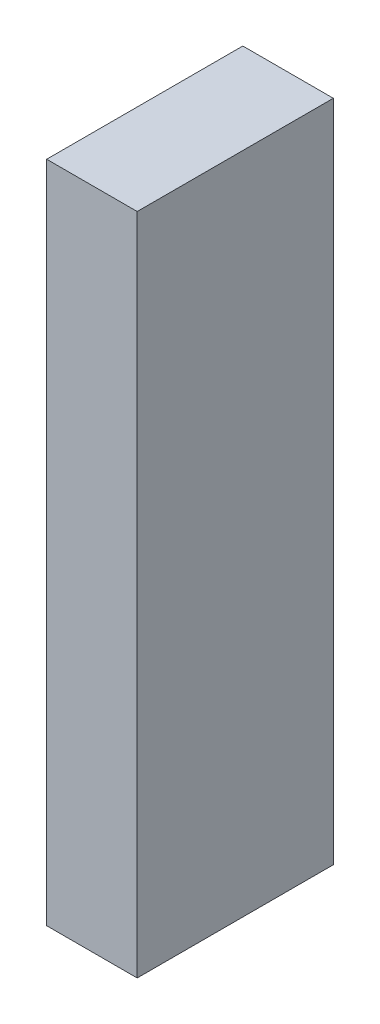
ISO-10303-21;
HEADER;
FILE_DESCRIPTION(('STEP AP214'),'2;1');
FILE_NAME('part.step','',(''),(''),'','','');
FILE_SCHEMA(('AUTOMOTIVE_DESIGN { 1 0 10303 214 1 1 1 1 }'));
ENDSEC;
DATA;
#1=APPLICATION_CONTEXT('core data for automotive mechanical design processes');
#2=APPLICATION_PROTOCOL_DEFINITION('international standard','automotive_design',2000,#1);
#3=PRODUCT_CONTEXT('',#1,'mechanical');
#4=PRODUCT('Part','Part','',(#3));
#5=PRODUCT_RELATED_PRODUCT_CATEGORY('part','',(#4));
#6=PRODUCT_DEFINITION_FORMATION('','',#4);
#7=PRODUCT_DEFINITION_CONTEXT('part definition',#1,'design');
#8=PRODUCT_DEFINITION('design','',#6,#7);
#9=PRODUCT_DEFINITION_SHAPE('','',#8);
#10=(LENGTH_UNIT() NAMED_UNIT(*) SI_UNIT(.MILLI.,.METRE.));
#11=(NAMED_UNIT(*) PLANE_ANGLE_UNIT() SI_UNIT($,.RADIAN.));
#12=(NAMED_UNIT(*) SI_UNIT($,.STERADIAN.) SOLID_ANGLE_UNIT());
#13=UNCERTAINTY_MEASURE_WITH_UNIT(LENGTH_MEASURE(1.E-05),#10,'distance_accuracy_value','');
#14=(GEOMETRIC_REPRESENTATION_CONTEXT(3) GLOBAL_UNCERTAINTY_ASSIGNED_CONTEXT((#13)) GLOBAL_UNIT_ASSIGNED_CONTEXT((#10,
#11,#12)) REPRESENTATION_CONTEXT('',''));
#15=CARTESIAN_POINT('',(0.,0.,0.));
#16=DIRECTION('',(0.,0.,1.));
#17=DIRECTION('',(1.,0.,0.));
#18=AXIS2_PLACEMENT_3D('',#15,#16,#17);
#19=CARTESIAN_POINT('',(-2.,-1.1,0.));
#20=DIRECTION('',(1.,0.,0.));
#21=DIRECTION('',(0.,0.,-1.));
#22=AXIS2_PLACEMENT_3D('',#19,#20,#21);
#23=PLANE('',#22);
#24=DIRECTION('',(0.,0.,1.));
#25=VECTOR('',#24,1.);
#26=CARTESIAN_POINT('',(-2.,-1.1,0.));
#27=LINE('',#26,#25);
#28=CARTESIAN_POINT('',(-2.,-1.1,0.65));
#29=VERTEX_POINT('',#28);
#30=CARTESIAN_POINT('',(-2.,-1.1,0.));
#31=VERTEX_POINT('',#30);
#32=EDGE_CURVE('E55',#29,#31,#27,.F.);
#33=ORIENTED_EDGE('',*,*,#32,.T.);
#34=DIRECTION('',(0.,1.,0.));
#35=VECTOR('',#34,1.);
#36=CARTESIAN_POINT('',(-2.,-1.1,0.));
#37=LINE('',#36,#35);
#38=CARTESIAN_POINT('',(-2.,1.1,0.));
#39=VERTEX_POINT('',#38);
#40=EDGE_CURVE('E75',#31,#39,#37,.T.);
#41=ORIENTED_EDGE('',*,*,#40,.T.);
#42=DIRECTION('',(0.,0.,-1.));
#43=VECTOR('',#42,1.);
#44=CARTESIAN_POINT('',(-2.,1.1,0.));
#45=LINE('',#44,#43);
#46=CARTESIAN_POINT('',(-2.,1.1,0.65));
#47=VERTEX_POINT('',#46);
#48=EDGE_CURVE('E20',#39,#47,#45,.F.);
#49=ORIENTED_EDGE('',*,*,#48,.T.);
#50=DIRECTION('',(0.,1.,0.));
#51=VECTOR('',#50,1.);
#52=CARTESIAN_POINT('',(-2.,-1.1,0.65));
#53=LINE('',#52,#51);
#54=EDGE_CURVE('E65',#29,#47,#53,.T.);
#55=ORIENTED_EDGE('',*,*,#54,.F.);
#56=EDGE_LOOP('',(#33,#41,#49,#55));
#57=FACE_BOUND('',#56,.T.);
#58=ADVANCED_FACE('F17',(#57),#23,.T.);
#59=CARTESIAN_POINT('',(-2.3,-1.1,0.65));
#60=DIRECTION('',(0.,0.,1.));
#61=DIRECTION('',(1.,0.,0.));
#62=AXIS2_PLACEMENT_3D('',#59,#60,#61);
#63=PLANE('',#62);
#64=DIRECTION('',(0.,1.,0.));
#65=VECTOR('',#64,1.);
#66=CARTESIAN_POINT('',(-2.3,-1.1,0.65));
#67=LINE('',#66,#65);
#68=CARTESIAN_POINT('',(-2.3,1.1,0.65));
#69=VERTEX_POINT('',#68);
#70=CARTESIAN_POINT('',(-2.3,-1.1,0.65));
#71=VERTEX_POINT('',#70);
#72=EDGE_CURVE('E73',#69,#71,#67,.F.);
#73=ORIENTED_EDGE('',*,*,#72,.T.);
#74=DIRECTION('',(1.,0.,0.));
#75=VECTOR('',#74,1.);
#76=CARTESIAN_POINT('',(-2.3,-1.1,0.65));
#77=LINE('',#76,#75);
#78=EDGE_CURVE('E62',#71,#29,#77,.T.);
#79=ORIENTED_EDGE('',*,*,#78,.T.);
#80=ORIENTED_EDGE('',*,*,#54,.T.);
#81=DIRECTION('',(1.,0.,0.));
#82=VECTOR('',#81,1.);
#83=CARTESIAN_POINT('',(-2.3,1.1,0.65));
#84=LINE('',#83,#82);
#85=EDGE_CURVE('E79',#69,#47,#84,.T.);
#86=ORIENTED_EDGE('',*,*,#85,.F.);
#87=EDGE_LOOP('',(#73,#79,#80,#86));
#88=FACE_BOUND('',#87,.T.);
#89=ADVANCED_FACE('F72',(#88),#63,.T.);
#90=CARTESIAN_POINT('',(-2.3,-1.1,0.));
#91=DIRECTION('',(0.,1.,0.));
#92=DIRECTION('',(0.,0.,1.));
#93=AXIS2_PLACEMENT_3D('',#90,#91,#92);
#94=PLANE('',#93);
#95=DIRECTION('',(0.,0.,-1.));
#96=VECTOR('',#95,1.);
#97=CARTESIAN_POINT('',(-2.3,-1.1,0.));
#98=LINE('',#97,#96);
#99=CARTESIAN_POINT('',(-2.3,-1.1,0.));
#100=VERTEX_POINT('',#99);
#101=EDGE_CURVE('E83',#71,#100,#98,.T.);
#102=ORIENTED_EDGE('',*,*,#101,.T.);
#103=DIRECTION('',(1.,0.,0.));
#104=VECTOR('',#103,1.);
#105=CARTESIAN_POINT('',(-2.3,-1.1,0.));
#106=LINE('',#105,#104);
#107=EDGE_CURVE('E64',#100,#31,#106,.T.);
#108=ORIENTED_EDGE('',*,*,#107,.T.);
#109=ORIENTED_EDGE('',*,*,#32,.F.);
#110=ORIENTED_EDGE('',*,*,#78,.F.);
#111=EDGE_LOOP('',(#102,#108,#109,#110));
#112=FACE_BOUND('',#111,.T.);
#113=ADVANCED_FACE('F60',(#112),#94,.F.);
#114=CARTESIAN_POINT('',(-2.3,-1.1,0.));
#115=DIRECTION('',(0.,0.,1.));
#116=DIRECTION('',(1.,0.,0.));
#117=AXIS2_PLACEMENT_3D('',#114,#115,#116);
#118=PLANE('',#117);
#119=ORIENTED_EDGE('',*,*,#107,.F.);
#120=DIRECTION('',(0.,1.,0.));
#121=VECTOR('',#120,1.);
#122=CARTESIAN_POINT('',(-2.3,-1.1,0.));
#123=LINE('',#122,#121);
#124=CARTESIAN_POINT('',(-2.3,1.1,0.));
#125=VERTEX_POINT('',#124);
#126=EDGE_CURVE('E26',#100,#125,#123,.T.);
#127=ORIENTED_EDGE('',*,*,#126,.T.);
#128=DIRECTION('',(1.,0.,0.));
#129=VECTOR('',#128,1.);
#130=CARTESIAN_POINT('',(-2.3,1.1,0.));
#131=LINE('',#130,#129);
#132=EDGE_CURVE('E34',#39,#125,#131,.F.);
#133=ORIENTED_EDGE('',*,*,#132,.F.);
#134=ORIENTED_EDGE('',*,*,#40,.F.);
#135=EDGE_LOOP('',(#119,#127,#133,#134));
#136=FACE_BOUND('',#135,.T.);
#137=ADVANCED_FACE('F88',(#136),#118,.F.);
#138=CARTESIAN_POINT('',(-2.3,1.1,0.));
#139=DIRECTION('',(0.,1.,0.));
#140=DIRECTION('',(0.,0.,1.));
#141=AXIS2_PLACEMENT_3D('',#138,#139,#140);
#142=PLANE('',#141);
#143=ORIENTED_EDGE('',*,*,#132,.T.);
#144=DIRECTION('',(0.,0.,-1.));
#145=VECTOR('',#144,1.);
#146=CARTESIAN_POINT('',(-2.3,1.1,0.));
#147=LINE('',#146,#145);
#148=EDGE_CURVE('E11',#125,#69,#147,.F.);
#149=ORIENTED_EDGE('',*,*,#148,.T.);
#150=ORIENTED_EDGE('',*,*,#85,.T.);
#151=ORIENTED_EDGE('',*,*,#48,.F.);
#152=EDGE_LOOP('',(#143,#149,#150,#151));
#153=FACE_BOUND('',#152,.T.);
#154=ADVANCED_FACE('F91',(#153),#142,.T.);
#155=CARTESIAN_POINT('',(-2.3,-1.1,0.));
#156=DIRECTION('',(1.,0.,0.));
#157=DIRECTION('',(0.,0.,-1.));
#158=AXIS2_PLACEMENT_3D('',#155,#156,#157);
#159=PLANE('',#158);
#160=ORIENTED_EDGE('',*,*,#126,.F.);
#161=ORIENTED_EDGE('',*,*,#101,.F.);
#162=ORIENTED_EDGE('',*,*,#72,.F.);
#163=ORIENTED_EDGE('',*,*,#148,.F.);
#164=EDGE_LOOP('',(#160,#161,#162,#163));
#165=FACE_BOUND('',#164,.T.);
#166=ADVANCED_FACE('F90',(#165),#159,.F.);
#167=CLOSED_SHELL('',(#58,#89,#113,#137,#154,#166));
#168=MANIFOLD_SOLID_BREP('B1',#167);
#169=ADVANCED_BREP_SHAPE_REPRESENTATION('',(#18,#168),#14);
#170=SHAPE_DEFINITION_REPRESENTATION(#9,#169);
ENDSEC;
END-ISO-10303-21;
